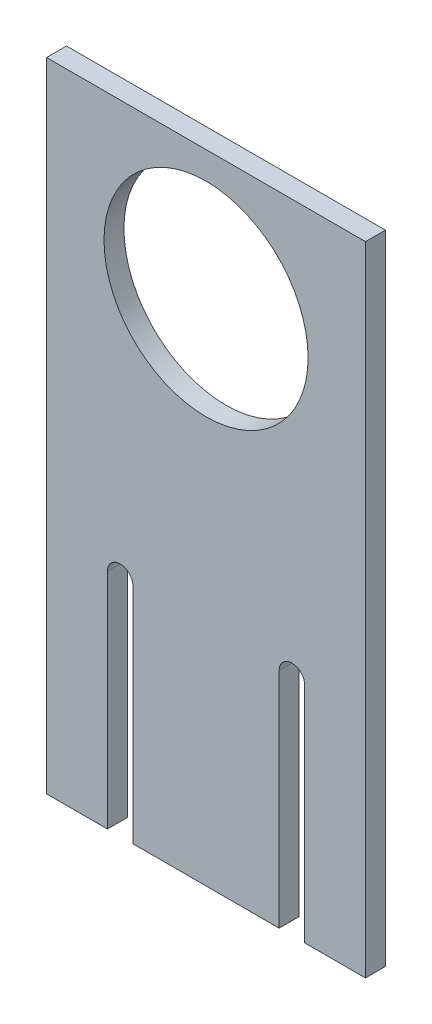
ISO-10303-21;
HEADER;
FILE_DESCRIPTION(('STEP AP214'),'2;1');
FILE_NAME('part.step','',(''),(''),'','','');
FILE_SCHEMA(('AUTOMOTIVE_DESIGN { 1 0 10303 214 1 1 1 1 }'));
ENDSEC;
DATA;
#1=APPLICATION_CONTEXT('core data for automotive mechanical design processes');
#2=APPLICATION_PROTOCOL_DEFINITION('international standard','automotive_design',2000,#1);
#3=PRODUCT_CONTEXT('',#1,'mechanical');
#4=PRODUCT('Part','Part','',(#3));
#5=PRODUCT_RELATED_PRODUCT_CATEGORY('part','',(#4));
#6=PRODUCT_DEFINITION_FORMATION('','',#4);
#7=PRODUCT_DEFINITION_CONTEXT('part definition',#1,'design');
#8=PRODUCT_DEFINITION('design','',#6,#7);
#9=PRODUCT_DEFINITION_SHAPE('','',#8);
#10=(LENGTH_UNIT() NAMED_UNIT(*) SI_UNIT(.MILLI.,.METRE.));
#11=(NAMED_UNIT(*) PLANE_ANGLE_UNIT() SI_UNIT($,.RADIAN.));
#12=(NAMED_UNIT(*) SI_UNIT($,.STERADIAN.) SOLID_ANGLE_UNIT());
#13=UNCERTAINTY_MEASURE_WITH_UNIT(LENGTH_MEASURE(1.E-05),#10,'distance_accuracy_value','');
#14=(GEOMETRIC_REPRESENTATION_CONTEXT(3) GLOBAL_UNCERTAINTY_ASSIGNED_CONTEXT((#13)) GLOBAL_UNIT_ASSIGNED_CONTEXT((#10,
#11,#12)) REPRESENTATION_CONTEXT('',''));
#15=CARTESIAN_POINT('',(0.,0.,0.));
#16=DIRECTION('',(0.,0.,1.));
#17=DIRECTION('',(1.,0.,0.));
#18=AXIS2_PLACEMENT_3D('',#15,#16,#17);
#19=CARTESIAN_POINT('',(0.,0.,3.125));
#20=DIRECTION('',(0.,1.,0.));
#21=DIRECTION('',(-1.,0.,0.));
#22=AXIS2_PLACEMENT_3D('',#19,#20,#21);
#23=PLANE('',#22);
#24=DIRECTION('',(1.,0.,0.));
#25=VECTOR('',#24,1.);
#26=CARTESIAN_POINT('',(0.,0.,3.125));
#27=LINE('',#26,#25);
#28=CARTESIAN_POINT('',(-9.53527390277907,0.,3.125));
#29=VERTEX_POINT('',#28);
#30=CARTESIAN_POINT('',(0.,0.,3.125));
#31=VERTEX_POINT('',#30);
#32=EDGE_CURVE('E194',#29,#31,#27,.T.);
#33=ORIENTED_EDGE('',*,*,#32,.F.);
#34=DIRECTION('',(0.,0.,1.));
#35=VECTOR('',#34,1.);
#36=CARTESIAN_POINT('',(-9.53527390277907,0.,0.));
#37=LINE('',#36,#35);
#38=CARTESIAN_POINT('',(-9.53527390277907,0.,0.));
#39=VERTEX_POINT('',#38);
#40=EDGE_CURVE('E154',#39,#29,#37,.T.);
#41=ORIENTED_EDGE('',*,*,#40,.F.);
#42=DIRECTION('',(1.,0.,0.));
#43=VECTOR('',#42,1.);
#44=CARTESIAN_POINT('',(0.,0.,0.));
#45=LINE('',#44,#43);
#46=CARTESIAN_POINT('',(0.,0.,0.));
#47=VERTEX_POINT('',#46);
#48=EDGE_CURVE('E206',#39,#47,#45,.T.);
#49=ORIENTED_EDGE('',*,*,#48,.T.);
#50=DIRECTION('',(0.,0.,-1.));
#51=VECTOR('',#50,1.);
#52=CARTESIAN_POINT('',(0.,0.,3.125));
#53=LINE('',#52,#51);
#54=EDGE_CURVE('E198',#31,#47,#53,.T.);
#55=ORIENTED_EDGE('',*,*,#54,.F.);
#56=EDGE_LOOP('',(#33,#41,#49,#55));
#57=FACE_BOUND('',#56,.T.);
#58=ADVANCED_FACE('F33',(#57),#23,.F.);
#59=CARTESIAN_POINT('',(-36.4647260972209,0.,0.));
#60=VERTEX_POINT('',#59);
#61=CARTESIAN_POINT('',(-13.5352739027791,0.,0.));
#62=VERTEX_POINT('',#61);
#63=EDGE_CURVE('E209',#60,#62,#45,.T.);
#64=ORIENTED_EDGE('',*,*,#63,.T.);
#65=DIRECTION('',(0.,0.,1.));
#66=VECTOR('',#65,1.);
#67=CARTESIAN_POINT('',(-13.5352739027791,0.,0.));
#68=LINE('',#67,#66);
#69=CARTESIAN_POINT('',(-13.5352739027791,0.,3.125));
#70=VERTEX_POINT('',#69);
#71=EDGE_CURVE('E48',#62,#70,#68,.T.);
#72=ORIENTED_EDGE('',*,*,#71,.T.);
#73=CARTESIAN_POINT('',(-36.4647260972209,0.,3.125));
#74=VERTEX_POINT('',#73);
#75=EDGE_CURVE('E199',#74,#70,#27,.T.);
#76=ORIENTED_EDGE('',*,*,#75,.F.);
#77=DIRECTION('',(0.,0.,1.));
#78=VECTOR('',#77,1.);
#79=CARTESIAN_POINT('',(-36.4647260972209,0.,0.));
#80=LINE('',#79,#78);
#81=EDGE_CURVE('E176',#60,#74,#80,.T.);
#82=ORIENTED_EDGE('',*,*,#81,.F.);
#83=EDGE_LOOP('',(#64,#72,#76,#82));
#84=FACE_BOUND('',#83,.T.);
#85=ADVANCED_FACE('F242',(#84),#23,.F.);
#86=CARTESIAN_POINT('',(0.,0.,3.125));
#87=DIRECTION('',(-1.,0.,0.));
#88=DIRECTION('',(0.,0.,1.));
#89=AXIS2_PLACEMENT_3D('',#86,#87,#88);
#90=PLANE('',#89);
#91=DIRECTION('',(0.,1.,0.));
#92=VECTOR('',#91,1.);
#93=CARTESIAN_POINT('',(0.,0.,0.));
#94=LINE('',#93,#92);
#95=CARTESIAN_POINT('',(0.,100.,0.));
#96=VERTEX_POINT('',#95);
#97=EDGE_CURVE('E183',#47,#96,#94,.T.);
#98=ORIENTED_EDGE('',*,*,#97,.T.);
#99=DIRECTION('',(0.,0.,-1.));
#100=VECTOR('',#99,1.);
#101=CARTESIAN_POINT('',(0.,100.,3.125));
#102=LINE('',#101,#100);
#103=CARTESIAN_POINT('',(0.,100.,3.125));
#104=VERTEX_POINT('',#103);
#105=EDGE_CURVE('E11',#104,#96,#102,.T.);
#106=ORIENTED_EDGE('',*,*,#105,.F.);
#107=DIRECTION('',(0.,1.,0.));
#108=VECTOR('',#107,1.);
#109=CARTESIAN_POINT('',(0.,0.,3.125));
#110=LINE('',#109,#108);
#111=EDGE_CURVE('E186',#31,#104,#110,.T.);
#112=ORIENTED_EDGE('',*,*,#111,.F.);
#113=ORIENTED_EDGE('',*,*,#54,.T.);
#114=EDGE_LOOP('',(#98,#106,#112,#113));
#115=FACE_BOUND('',#114,.T.);
#116=ADVANCED_FACE('F35',(#115),#90,.F.);
#117=CARTESIAN_POINT('',(0.,100.,3.125));
#118=DIRECTION('',(0.,-1.,0.));
#119=DIRECTION('',(1.,0.,0.));
#120=AXIS2_PLACEMENT_3D('',#117,#118,#119);
#121=PLANE('',#120);
#122=DIRECTION('',(-1.,0.,0.));
#123=VECTOR('',#122,1.);
#124=CARTESIAN_POINT('',(0.,100.,0.));
#125=LINE('',#124,#123);
#126=CARTESIAN_POINT('',(-50.,100.,0.));
#127=VERTEX_POINT('',#126);
#128=EDGE_CURVE('E202',#96,#127,#125,.T.);
#129=ORIENTED_EDGE('',*,*,#128,.T.);
#130=DIRECTION('',(0.,0.,-1.));
#131=VECTOR('',#130,1.);
#132=CARTESIAN_POINT('',(-50.,100.,3.125));
#133=LINE('',#132,#131);
#134=CARTESIAN_POINT('',(-50.,100.,3.125));
#135=VERTEX_POINT('',#134);
#136=EDGE_CURVE('E41',#135,#127,#133,.T.);
#137=ORIENTED_EDGE('',*,*,#136,.F.);
#138=DIRECTION('',(-1.,0.,0.));
#139=VECTOR('',#138,1.);
#140=CARTESIAN_POINT('',(0.,100.,3.125));
#141=LINE('',#140,#139);
#142=EDGE_CURVE('E189',#104,#135,#141,.T.);
#143=ORIENTED_EDGE('',*,*,#142,.F.);
#144=ORIENTED_EDGE('',*,*,#105,.T.);
#145=EDGE_LOOP('',(#129,#137,#143,#144));
#146=FACE_BOUND('',#145,.T.);
#147=ADVANCED_FACE('F235',(#146),#121,.F.);
#148=CARTESIAN_POINT('',(-50.,0.,3.125));
#149=DIRECTION('',(1.,0.,0.));
#150=DIRECTION('',(0.,0.,-1.));
#151=AXIS2_PLACEMENT_3D('',#148,#149,#150);
#152=PLANE('',#151);
#153=DIRECTION('',(0.,-1.,0.));
#154=VECTOR('',#153,1.);
#155=CARTESIAN_POINT('',(-50.,0.,0.));
#156=LINE('',#155,#154);
#157=CARTESIAN_POINT('',(-50.,0.,0.));
#158=VERTEX_POINT('',#157);
#159=EDGE_CURVE('E204',#127,#158,#156,.T.);
#160=ORIENTED_EDGE('',*,*,#159,.T.);
#161=DIRECTION('',(0.,0.,-1.));
#162=VECTOR('',#161,1.);
#163=CARTESIAN_POINT('',(-50.,0.,3.125));
#164=LINE('',#163,#162);
#165=CARTESIAN_POINT('',(-50.,0.,3.125));
#166=VERTEX_POINT('',#165);
#167=EDGE_CURVE('E212',#166,#158,#164,.T.);
#168=ORIENTED_EDGE('',*,*,#167,.F.);
#169=DIRECTION('',(0.,-1.,0.));
#170=VECTOR('',#169,1.);
#171=CARTESIAN_POINT('',(-50.,0.,3.125));
#172=LINE('',#171,#170);
#173=EDGE_CURVE('E192',#135,#166,#172,.T.);
#174=ORIENTED_EDGE('',*,*,#173,.F.);
#175=ORIENTED_EDGE('',*,*,#136,.T.);
#176=EDGE_LOOP('',(#160,#168,#174,#175));
#177=FACE_BOUND('',#176,.T.);
#178=ADVANCED_FACE('F219',(#177),#152,.F.);
#179=CARTESIAN_POINT('',(-40.4647260972209,0.,0.));
#180=VERTEX_POINT('',#179);
#181=EDGE_CURVE('E190',#158,#180,#45,.T.);
#182=ORIENTED_EDGE('',*,*,#181,.T.);
#183=DIRECTION('',(0.,0.,1.));
#184=VECTOR('',#183,1.);
#185=CARTESIAN_POINT('',(-40.4647260972209,0.,0.));
#186=LINE('',#185,#184);
#187=CARTESIAN_POINT('',(-40.4647260972209,0.,3.125));
#188=VERTEX_POINT('',#187);
#189=EDGE_CURVE('E56',#180,#188,#186,.T.);
#190=ORIENTED_EDGE('',*,*,#189,.T.);
#191=EDGE_CURVE('E195',#166,#188,#27,.T.);
#192=ORIENTED_EDGE('',*,*,#191,.F.);
#193=ORIENTED_EDGE('',*,*,#167,.T.);
#194=EDGE_LOOP('',(#182,#190,#192,#193));
#195=FACE_BOUND('',#194,.T.);
#196=ADVANCED_FACE('F225',(#195),#23,.F.);
#197=CARTESIAN_POINT('',(0.,0.,3.125));
#198=DIRECTION('',(0.,0.,1.));
#199=DIRECTION('',(1.,0.,0.));
#200=AXIS2_PLACEMENT_3D('',#197,#198,#199);
#201=PLANE('',#200);
#202=DIRECTION('',(0.,1.,0.));
#203=VECTOR('',#202,1.);
#204=CARTESIAN_POINT('',(-9.53527390277907,0.,3.125));
#205=LINE('',#204,#203);
#206=CARTESIAN_POINT('',(-9.53527390277907,35.,3.125));
#207=VERTEX_POINT('',#206);
#208=EDGE_CURVE('E142',#29,#207,#205,.T.);
#209=ORIENTED_EDGE('',*,*,#208,.F.);
#210=ORIENTED_EDGE('',*,*,#32,.T.);
#211=ORIENTED_EDGE('',*,*,#111,.T.);
#212=ORIENTED_EDGE('',*,*,#142,.T.);
#213=ORIENTED_EDGE('',*,*,#173,.T.);
#214=ORIENTED_EDGE('',*,*,#191,.T.);
#215=DIRECTION('',(0.,-1.,0.));
#216=VECTOR('',#215,1.);
#217=CARTESIAN_POINT('',(-40.4647260972209,0.,3.125));
#218=LINE('',#217,#216);
#219=CARTESIAN_POINT('',(-40.4647260972209,35.,3.125));
#220=VERTEX_POINT('',#219);
#221=EDGE_CURVE('E169',#220,#188,#218,.T.);
#222=ORIENTED_EDGE('',*,*,#221,.F.);
#223=CARTESIAN_POINT('',(-38.4647260972209,35.,3.125));
#224=DIRECTION('',(0.,0.,1.));
#225=DIRECTION('',(1.,0.,0.));
#226=AXIS2_PLACEMENT_3D('',#223,#224,#225);
#227=CIRCLE('',#226,2.);
#228=CARTESIAN_POINT('',(-36.4647260972209,35.,3.125));
#229=VERTEX_POINT('',#228);
#230=EDGE_CURVE('E153',#229,#220,#227,.T.);
#231=ORIENTED_EDGE('',*,*,#230,.F.);
#232=DIRECTION('',(0.,1.,0.));
#233=VECTOR('',#232,1.);
#234=CARTESIAN_POINT('',(-36.4647260972209,35.,3.125));
#235=LINE('',#234,#233);
#236=EDGE_CURVE('E161',#74,#229,#235,.T.);
#237=ORIENTED_EDGE('',*,*,#236,.F.);
#238=ORIENTED_EDGE('',*,*,#75,.T.);
#239=DIRECTION('',(0.,-1.,0.));
#240=VECTOR('',#239,1.);
#241=CARTESIAN_POINT('',(-13.5352739027791,35.,3.125));
#242=LINE('',#241,#240);
#243=CARTESIAN_POINT('',(-13.5352739027791,35.,3.125));
#244=VERTEX_POINT('',#243);
#245=EDGE_CURVE('E145',#244,#70,#242,.T.);
#246=ORIENTED_EDGE('',*,*,#245,.F.);
#247=CARTESIAN_POINT('',(-11.5352739027791,35.,3.125));
#248=DIRECTION('',(0.,0.,1.));
#249=DIRECTION('',(-1.,0.,0.));
#250=AXIS2_PLACEMENT_3D('',#247,#248,#249);
#251=CIRCLE('',#250,2.);
#252=EDGE_CURVE('E130',#207,#244,#251,.T.);
#253=ORIENTED_EDGE('',*,*,#252,.F.);
#254=EDGE_LOOP('',(#209,#210,#211,#212,#213,#214,#222,#231,#237,#238,#246,#253));
#255=FACE_BOUND('',#254,.T.);
#256=CARTESIAN_POINT('',(-25.,79.7127865126919,3.125));
#257=DIRECTION('',(0.,0.,1.));
#258=DIRECTION('',(1.,0.,0.));
#259=AXIS2_PLACEMENT_3D('',#256,#257,#258);
#260=CIRCLE('',#259,16.);
#261=CARTESIAN_POINT('',(-9.,79.7127865126919,3.125));
#262=VERTEX_POINT('',#261);
#263=EDGE_CURVE('E175',#262,#262,#260,.T.);
#264=ORIENTED_EDGE('',*,*,#263,.F.);
#265=EDGE_LOOP('',(#264));
#266=FACE_BOUND('',#265,.T.);
#267=ADVANCED_FACE('F230',(#255,#266),#201,.T.);
#268=CARTESIAN_POINT('',(0.,0.,0.));
#269=DIRECTION('',(0.,0.,1.));
#270=DIRECTION('',(1.,0.,0.));
#271=AXIS2_PLACEMENT_3D('',#268,#269,#270);
#272=PLANE('',#271);
#273=CARTESIAN_POINT('',(-25.,79.7127865126919,0.));
#274=DIRECTION('',(0.,0.,1.));
#275=DIRECTION('',(1.,0.,0.));
#276=AXIS2_PLACEMENT_3D('',#273,#274,#275);
#277=CIRCLE('',#276,16.);
#278=CARTESIAN_POINT('',(-9.,79.7127865126919,0.));
#279=VERTEX_POINT('',#278);
#280=EDGE_CURVE('E180',#279,#279,#277,.T.);
#281=ORIENTED_EDGE('',*,*,#280,.T.);
#282=EDGE_LOOP('',(#281));
#283=FACE_BOUND('',#282,.T.);
#284=ORIENTED_EDGE('',*,*,#48,.F.);
#285=DIRECTION('',(0.,1.,0.));
#286=VECTOR('',#285,1.);
#287=CARTESIAN_POINT('',(-9.53527390277907,0.,0.));
#288=LINE('',#287,#286);
#289=CARTESIAN_POINT('',(-9.53527390277907,35.,0.));
#290=VERTEX_POINT('',#289);
#291=EDGE_CURVE('E132',#39,#290,#288,.T.);
#292=ORIENTED_EDGE('',*,*,#291,.T.);
#293=CARTESIAN_POINT('',(-11.5352739027791,35.,0.));
#294=DIRECTION('',(0.,0.,1.));
#295=DIRECTION('',(-1.,0.,0.));
#296=AXIS2_PLACEMENT_3D('',#293,#294,#295);
#297=CIRCLE('',#296,2.);
#298=CARTESIAN_POINT('',(-13.5352739027791,35.,0.));
#299=VERTEX_POINT('',#298);
#300=EDGE_CURVE('E127',#290,#299,#297,.T.);
#301=ORIENTED_EDGE('',*,*,#300,.T.);
#302=DIRECTION('',(0.,-1.,0.));
#303=VECTOR('',#302,1.);
#304=CARTESIAN_POINT('',(-13.5352739027791,35.,0.));
#305=LINE('',#304,#303);
#306=EDGE_CURVE('E134',#299,#62,#305,.T.);
#307=ORIENTED_EDGE('',*,*,#306,.T.);
#308=ORIENTED_EDGE('',*,*,#63,.F.);
#309=DIRECTION('',(0.,1.,0.));
#310=VECTOR('',#309,1.);
#311=CARTESIAN_POINT('',(-36.4647260972209,35.,0.));
#312=LINE('',#311,#310);
#313=CARTESIAN_POINT('',(-36.4647260972209,35.,0.));
#314=VERTEX_POINT('',#313);
#315=EDGE_CURVE('E163',#60,#314,#312,.T.);
#316=ORIENTED_EDGE('',*,*,#315,.T.);
#317=CARTESIAN_POINT('',(-38.4647260972209,35.,0.));
#318=DIRECTION('',(0.,0.,1.));
#319=DIRECTION('',(1.,0.,0.));
#320=AXIS2_PLACEMENT_3D('',#317,#318,#319);
#321=CIRCLE('',#320,2.);
#322=CARTESIAN_POINT('',(-40.4647260972209,35.,0.));
#323=VERTEX_POINT('',#322);
#324=EDGE_CURVE('E157',#314,#323,#321,.T.);
#325=ORIENTED_EDGE('',*,*,#324,.T.);
#326=DIRECTION('',(0.,-1.,0.));
#327=VECTOR('',#326,1.);
#328=CARTESIAN_POINT('',(-40.4647260972209,0.,0.));
#329=LINE('',#328,#327);
#330=EDGE_CURVE('E160',#323,#180,#329,.T.);
#331=ORIENTED_EDGE('',*,*,#330,.T.);
#332=ORIENTED_EDGE('',*,*,#181,.F.);
#333=ORIENTED_EDGE('',*,*,#159,.F.);
#334=ORIENTED_EDGE('',*,*,#128,.F.);
#335=ORIENTED_EDGE('',*,*,#97,.F.);
#336=EDGE_LOOP('',(#284,#292,#301,#307,#308,#316,#325,#331,#332,#333,#334,#335));
#337=FACE_BOUND('',#336,.T.);
#338=ADVANCED_FACE('F141',(#283,#337),#272,.F.);
#339=CARTESIAN_POINT('',(-25.,79.7127865126919,0.));
#340=DIRECTION('',(0.,0.,1.));
#341=DIRECTION('',(1.,0.,0.));
#342=AXIS2_PLACEMENT_3D('',#339,#340,#341);
#343=CYLINDRICAL_SURFACE('',#342,16.);
#344=ORIENTED_EDGE('',*,*,#280,.F.);
#345=EDGE_LOOP('',(#344));
#346=FACE_BOUND('',#345,.T.);
#347=ORIENTED_EDGE('',*,*,#263,.T.);
#348=EDGE_LOOP('',(#347));
#349=FACE_BOUND('',#348,.T.);
#350=ADVANCED_FACE('F310',(#346,#349),#343,.F.);
#351=CARTESIAN_POINT('',(-38.4647260972209,35.,0.));
#352=DIRECTION('',(0.,0.,1.));
#353=DIRECTION('',(1.,0.,0.));
#354=AXIS2_PLACEMENT_3D('',#351,#352,#353);
#355=CYLINDRICAL_SURFACE('',#354,2.);
#356=ORIENTED_EDGE('',*,*,#230,.T.);
#357=DIRECTION('',(0.,0.,1.));
#358=VECTOR('',#357,1.);
#359=CARTESIAN_POINT('',(-40.4647260972209,35.,0.));
#360=LINE('',#359,#358);
#361=EDGE_CURVE('E166',#323,#220,#360,.T.);
#362=ORIENTED_EDGE('',*,*,#361,.F.);
#363=ORIENTED_EDGE('',*,*,#324,.F.);
#364=DIRECTION('',(0.,0.,1.));
#365=VECTOR('',#364,1.);
#366=CARTESIAN_POINT('',(-36.4647260972209,35.,0.));
#367=LINE('',#366,#365);
#368=EDGE_CURVE('E173',#314,#229,#367,.T.);
#369=ORIENTED_EDGE('',*,*,#368,.T.);
#370=EDGE_LOOP('',(#356,#362,#363,#369));
#371=FACE_BOUND('',#370,.T.);
#372=ADVANCED_FACE('F250',(#371),#355,.F.);
#373=CARTESIAN_POINT('',(-36.4647260972209,35.,0.));
#374=DIRECTION('',(1.,0.,0.));
#375=DIRECTION('',(0.,0.,-1.));
#376=AXIS2_PLACEMENT_3D('',#373,#374,#375);
#377=PLANE('',#376);
#378=ORIENTED_EDGE('',*,*,#236,.T.);
#379=ORIENTED_EDGE('',*,*,#368,.F.);
#380=ORIENTED_EDGE('',*,*,#315,.F.);
#381=ORIENTED_EDGE('',*,*,#81,.T.);
#382=EDGE_LOOP('',(#378,#379,#380,#381));
#383=FACE_BOUND('',#382,.T.);
#384=ADVANCED_FACE('F247',(#383),#377,.F.);
#385=CARTESIAN_POINT('',(-40.4647260972209,0.,0.));
#386=DIRECTION('',(-1.,0.,0.));
#387=DIRECTION('',(0.,0.,1.));
#388=AXIS2_PLACEMENT_3D('',#385,#386,#387);
#389=PLANE('',#388);
#390=ORIENTED_EDGE('',*,*,#221,.T.);
#391=ORIENTED_EDGE('',*,*,#189,.F.);
#392=ORIENTED_EDGE('',*,*,#330,.F.);
#393=ORIENTED_EDGE('',*,*,#361,.T.);
#394=EDGE_LOOP('',(#390,#391,#392,#393));
#395=FACE_BOUND('',#394,.T.);
#396=ADVANCED_FACE('F251',(#395),#389,.F.);
#397=CARTESIAN_POINT('',(-11.5352739027791,35.,0.));
#398=DIRECTION('',(0.,0.,1.));
#399=DIRECTION('',(1.,0.,0.));
#400=AXIS2_PLACEMENT_3D('',#397,#398,#399);
#401=CYLINDRICAL_SURFACE('',#400,2.);
#402=ORIENTED_EDGE('',*,*,#252,.T.);
#403=DIRECTION('',(0.,0.,1.));
#404=VECTOR('',#403,1.);
#405=CARTESIAN_POINT('',(-13.5352739027791,35.,0.));
#406=LINE('',#405,#404);
#407=EDGE_CURVE('E124',#299,#244,#406,.T.);
#408=ORIENTED_EDGE('',*,*,#407,.F.);
#409=ORIENTED_EDGE('',*,*,#300,.F.);
#410=DIRECTION('',(0.,0.,1.));
#411=VECTOR('',#410,1.);
#412=CARTESIAN_POINT('',(-9.53527390277907,35.,0.));
#413=LINE('',#412,#411);
#414=EDGE_CURVE('E151',#290,#207,#413,.T.);
#415=ORIENTED_EDGE('',*,*,#414,.T.);
#416=EDGE_LOOP('',(#402,#408,#409,#415));
#417=FACE_BOUND('',#416,.T.);
#418=ADVANCED_FACE('F125',(#417),#401,.F.);
#419=CARTESIAN_POINT('',(-9.53527390277907,0.,0.));
#420=DIRECTION('',(1.,0.,0.));
#421=DIRECTION('',(0.,0.,-1.));
#422=AXIS2_PLACEMENT_3D('',#419,#420,#421);
#423=PLANE('',#422);
#424=ORIENTED_EDGE('',*,*,#208,.T.);
#425=ORIENTED_EDGE('',*,*,#414,.F.);
#426=ORIENTED_EDGE('',*,*,#291,.F.);
#427=ORIENTED_EDGE('',*,*,#40,.T.);
#428=EDGE_LOOP('',(#424,#425,#426,#427));
#429=FACE_BOUND('',#428,.T.);
#430=ADVANCED_FACE('F258',(#429),#423,.F.);
#431=CARTESIAN_POINT('',(-13.5352739027791,35.,0.));
#432=DIRECTION('',(-1.,0.,0.));
#433=DIRECTION('',(0.,0.,1.));
#434=AXIS2_PLACEMENT_3D('',#431,#432,#433);
#435=PLANE('',#434);
#436=ORIENTED_EDGE('',*,*,#245,.T.);
#437=ORIENTED_EDGE('',*,*,#71,.F.);
#438=ORIENTED_EDGE('',*,*,#306,.F.);
#439=ORIENTED_EDGE('',*,*,#407,.T.);
#440=EDGE_LOOP('',(#436,#437,#438,#439));
#441=FACE_BOUND('',#440,.T.);
#442=ADVANCED_FACE('F135',(#441),#435,.F.);
#443=CLOSED_SHELL('',(#58,#85,#116,#147,#178,#196,#267,#338,#350,#372,#384,#396,#418,#430,#442));
#444=MANIFOLD_SOLID_BREP('B2',#443);
#445=ADVANCED_BREP_SHAPE_REPRESENTATION('',(#18,#444),#14);
#446=SHAPE_DEFINITION_REPRESENTATION(#9,#445);
ENDSEC;
END-ISO-10303-21;
